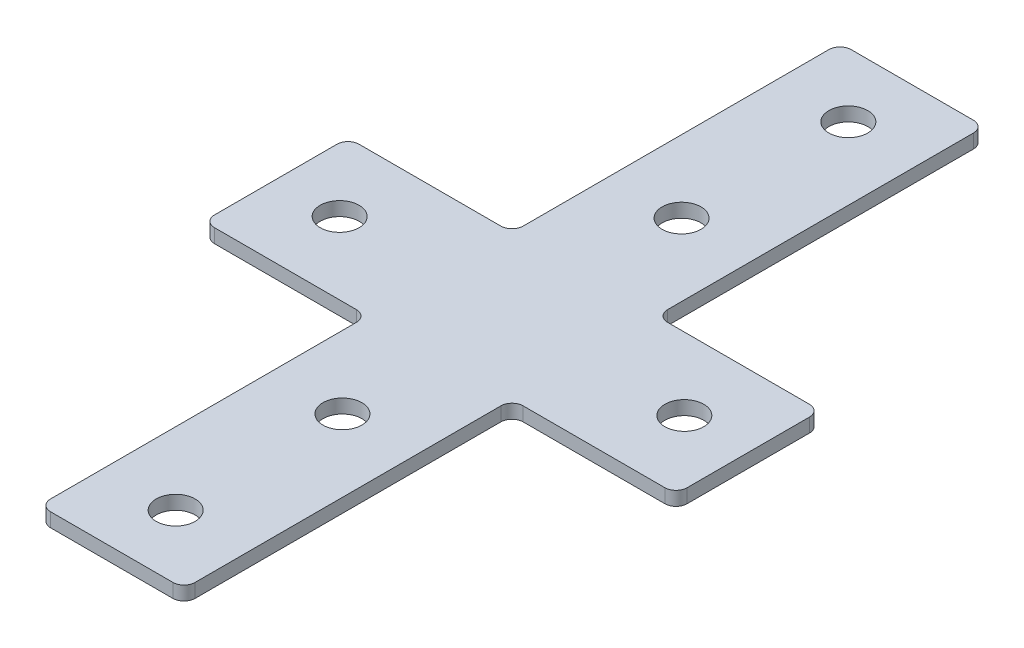
ISO-10303-21;
HEADER;
FILE_DESCRIPTION(('STEP AP214'),'2;1');
FILE_NAME('part.step','',(''),(''),'','','');
FILE_SCHEMA(('AUTOMOTIVE_DESIGN { 1 0 10303 214 1 1 1 1 }'));
ENDSEC;
DATA;
#1=APPLICATION_CONTEXT('core data for automotive mechanical design processes');
#2=APPLICATION_PROTOCOL_DEFINITION('international standard','automotive_design',2000,#1);
#3=PRODUCT_CONTEXT('',#1,'mechanical');
#4=PRODUCT('Part','Part','',(#3));
#5=PRODUCT_RELATED_PRODUCT_CATEGORY('part','',(#4));
#6=PRODUCT_DEFINITION_FORMATION('','',#4);
#7=PRODUCT_DEFINITION_CONTEXT('part definition',#1,'design');
#8=PRODUCT_DEFINITION('design','',#6,#7);
#9=PRODUCT_DEFINITION_SHAPE('','',#8);
#10=(LENGTH_UNIT() NAMED_UNIT(*) SI_UNIT(.MILLI.,.METRE.));
#11=(NAMED_UNIT(*) PLANE_ANGLE_UNIT() SI_UNIT($,.RADIAN.));
#12=(NAMED_UNIT(*) SI_UNIT($,.STERADIAN.) SOLID_ANGLE_UNIT());
#13=UNCERTAINTY_MEASURE_WITH_UNIT(LENGTH_MEASURE(1.E-05),#10,'distance_accuracy_value','');
#14=(GEOMETRIC_REPRESENTATION_CONTEXT(3) GLOBAL_UNCERTAINTY_ASSIGNED_CONTEXT((#13)) GLOBAL_UNIT_ASSIGNED_CONTEXT((#10,
#11,#12)) REPRESENTATION_CONTEXT('',''));
#15=CARTESIAN_POINT('',(0.,0.,0.));
#16=DIRECTION('',(0.,0.,1.));
#17=DIRECTION('',(1.,0.,0.));
#18=AXIS2_PLACEMENT_3D('',#15,#16,#17);
#19=CARTESIAN_POINT('',(0.,2.5,0.));
#20=DIRECTION('',(0.,1.,0.));
#21=DIRECTION('',(0.,0.,1.));
#22=AXIS2_PLACEMENT_3D('',#19,#20,#21);
#23=PLANE('',#22);
#24=CARTESIAN_POINT('',(0.,2.5,-60.5));
#25=DIRECTION('',(0.,1.,0.));
#26=DIRECTION('',(0.,0.,-1.));
#27=AXIS2_PLACEMENT_3D('',#24,#25,#26);
#28=CIRCLE('',#27,3.5);
#29=CARTESIAN_POINT('',(0.,2.5,-64.));
#30=VERTEX_POINT('',#29);
#31=EDGE_CURVE('E506',#30,#30,#28,.T.);
#32=ORIENTED_EDGE('',*,*,#31,.F.);
#33=EDGE_LOOP('',(#32));
#34=FACE_BOUND('',#33,.T.);
#35=CARTESIAN_POINT('',(-31.,2.5,0.));
#36=DIRECTION('',(0.,1.,0.));
#37=DIRECTION('',(0.,0.,1.));
#38=AXIS2_PLACEMENT_3D('',#35,#36,#37);
#39=CIRCLE('',#38,3.5);
#40=CARTESIAN_POINT('',(-31.,2.5,3.5));
#41=VERTEX_POINT('',#40);
#42=EDGE_CURVE('E494',#41,#41,#39,.T.);
#43=ORIENTED_EDGE('',*,*,#42,.F.);
#44=EDGE_LOOP('',(#43));
#45=FACE_BOUND('',#44,.T.);
#46=CARTESIAN_POINT('',(0.,2.5,60.5));
#47=DIRECTION('',(0.,1.,0.));
#48=DIRECTION('',(0.,0.,1.));
#49=AXIS2_PLACEMENT_3D('',#46,#47,#48);
#50=CIRCLE('',#49,3.5);
#51=CARTESIAN_POINT('',(0.,2.5,64.));
#52=VERTEX_POINT('',#51);
#53=EDGE_CURVE('E372',#52,#52,#50,.T.);
#54=ORIENTED_EDGE('',*,*,#53,.F.);
#55=EDGE_LOOP('',(#54));
#56=FACE_BOUND('',#55,.T.);
#57=DIRECTION('',(-1.,0.,0.));
#58=VECTOR('',#57,1.);
#59=CARTESIAN_POINT('',(-42.5,2.5,-13.));
#60=LINE('',#59,#58);
#61=CARTESIAN_POINT('',(-15.,2.5,-13.));
#62=VERTEX_POINT('',#61);
#63=CARTESIAN_POINT('',(-40.5,2.5,-13.));
#64=VERTEX_POINT('',#63);
#65=EDGE_CURVE('E349',#62,#64,#60,.T.);
#66=ORIENTED_EDGE('',*,*,#65,.T.);
#67=CARTESIAN_POINT('',(-40.5,2.5,-11.));
#68=DIRECTION('',(0.,1.,0.));
#69=DIRECTION('',(0.,0.,1.));
#70=AXIS2_PLACEMENT_3D('',#67,#68,#69);
#71=CIRCLE('',#70,2.);
#72=CARTESIAN_POINT('',(-42.5,2.5,-11.));
#73=VERTEX_POINT('',#72);
#74=EDGE_CURVE('E305',#64,#73,#71,.T.);
#75=ORIENTED_EDGE('',*,*,#74,.T.);
#76=DIRECTION('',(0.,0.,1.));
#77=VECTOR('',#76,1.);
#78=CARTESIAN_POINT('',(-42.5,2.5,-13.));
#79=LINE('',#78,#77);
#80=CARTESIAN_POINT('',(-42.5,2.5,11.));
#81=VERTEX_POINT('',#80);
#82=EDGE_CURVE('E355',#73,#81,#79,.T.);
#83=ORIENTED_EDGE('',*,*,#82,.T.);
#84=CARTESIAN_POINT('',(-40.5,2.5,11.));
#85=DIRECTION('',(0.,1.,0.));
#86=DIRECTION('',(0.,0.,1.));
#87=AXIS2_PLACEMENT_3D('',#84,#85,#86);
#88=CIRCLE('',#87,2.);
#89=CARTESIAN_POINT('',(-40.5,2.5,13.));
#90=VERTEX_POINT('',#89);
#91=EDGE_CURVE('E303',#81,#90,#88,.T.);
#92=ORIENTED_EDGE('',*,*,#91,.T.);
#93=DIRECTION('',(1.,0.,0.));
#94=VECTOR('',#93,1.);
#95=CARTESIAN_POINT('',(-42.5,2.5,13.));
#96=LINE('',#95,#94);
#97=CARTESIAN_POINT('',(-15.,2.5,13.));
#98=VERTEX_POINT('',#97);
#99=EDGE_CURVE('E358',#90,#98,#96,.T.);
#100=ORIENTED_EDGE('',*,*,#99,.T.);
#101=CARTESIAN_POINT('',(-15.,2.5,15.));
#102=DIRECTION('',(0.,1.,0.));
#103=DIRECTION('',(0.,0.,1.));
#104=AXIS2_PLACEMENT_3D('',#101,#102,#103);
#105=CIRCLE('',#104,2.);
#106=CARTESIAN_POINT('',(-13.,2.5,15.));
#107=VERTEX_POINT('',#106);
#108=EDGE_CURVE('E210',#98,#107,#105,.F.);
#109=ORIENTED_EDGE('',*,*,#108,.T.);
#110=DIRECTION('',(0.,0.,1.));
#111=VECTOR('',#110,1.);
#112=CARTESIAN_POINT('',(-13.,2.5,13.));
#113=LINE('',#112,#111);
#114=CARTESIAN_POINT('',(-13.,2.5,70.));
#115=VERTEX_POINT('',#114);
#116=EDGE_CURVE('E219',#107,#115,#113,.T.);
#117=ORIENTED_EDGE('',*,*,#116,.T.);
#118=CARTESIAN_POINT('',(-11.,2.5,70.));
#119=DIRECTION('',(0.,1.,0.));
#120=DIRECTION('',(0.,0.,1.));
#121=AXIS2_PLACEMENT_3D('',#118,#119,#120);
#122=CIRCLE('',#121,2.);
#123=CARTESIAN_POINT('',(-11.,2.5,72.));
#124=VERTEX_POINT('',#123);
#125=EDGE_CURVE('E60',#115,#124,#122,.T.);
#126=ORIENTED_EDGE('',*,*,#125,.T.);
#127=DIRECTION('',(1.,0.,0.));
#128=VECTOR('',#127,1.);
#129=CARTESIAN_POINT('',(-13.,2.5,72.));
#130=LINE('',#129,#128);
#131=CARTESIAN_POINT('',(11.,2.5,72.));
#132=VERTEX_POINT('',#131);
#133=EDGE_CURVE('E237',#124,#132,#130,.T.);
#134=ORIENTED_EDGE('',*,*,#133,.T.);
#135=CARTESIAN_POINT('',(11.,2.5,70.));
#136=DIRECTION('',(0.,1.,0.));
#137=DIRECTION('',(0.,0.,1.));
#138=AXIS2_PLACEMENT_3D('',#135,#136,#137);
#139=CIRCLE('',#138,2.);
#140=CARTESIAN_POINT('',(13.,2.5,70.));
#141=VERTEX_POINT('',#140);
#142=EDGE_CURVE('E300',#132,#141,#139,.T.);
#143=ORIENTED_EDGE('',*,*,#142,.T.);
#144=DIRECTION('',(0.,0.,-1.));
#145=VECTOR('',#144,1.);
#146=CARTESIAN_POINT('',(13.,2.5,13.));
#147=LINE('',#146,#145);
#148=CARTESIAN_POINT('',(13.,2.5,15.));
#149=VERTEX_POINT('',#148);
#150=EDGE_CURVE('E231',#141,#149,#147,.T.);
#151=ORIENTED_EDGE('',*,*,#150,.T.);
#152=CARTESIAN_POINT('',(15.,2.5,15.));
#153=DIRECTION('',(0.,1.,0.));
#154=DIRECTION('',(0.,0.,1.));
#155=AXIS2_PLACEMENT_3D('',#152,#153,#154);
#156=CIRCLE('',#155,2.);
#157=CARTESIAN_POINT('',(15.,2.5,13.));
#158=VERTEX_POINT('',#157);
#159=EDGE_CURVE('E323',#149,#158,#156,.F.);
#160=ORIENTED_EDGE('',*,*,#159,.T.);
#161=DIRECTION('',(1.,0.,0.));
#162=VECTOR('',#161,1.);
#163=CARTESIAN_POINT('',(13.,2.5,13.));
#164=LINE('',#163,#162);
#165=CARTESIAN_POINT('',(40.5,2.5,13.));
#166=VERTEX_POINT('',#165);
#167=EDGE_CURVE('E480',#158,#166,#164,.T.);
#168=ORIENTED_EDGE('',*,*,#167,.T.);
#169=CARTESIAN_POINT('',(40.5,2.5,11.));
#170=DIRECTION('',(0.,1.,0.));
#171=DIRECTION('',(0.,0.,1.));
#172=AXIS2_PLACEMENT_3D('',#169,#170,#171);
#173=CIRCLE('',#172,2.);
#174=CARTESIAN_POINT('',(42.5,2.5,11.));
#175=VERTEX_POINT('',#174);
#176=EDGE_CURVE('E298',#166,#175,#173,.T.);
#177=ORIENTED_EDGE('',*,*,#176,.T.);
#178=DIRECTION('',(0.,0.,-1.));
#179=VECTOR('',#178,1.);
#180=CARTESIAN_POINT('',(42.5,2.5,-13.));
#181=LINE('',#180,#179);
#182=CARTESIAN_POINT('',(42.5,2.5,-11.));
#183=VERTEX_POINT('',#182);
#184=EDGE_CURVE('E477',#175,#183,#181,.T.);
#185=ORIENTED_EDGE('',*,*,#184,.T.);
#186=CARTESIAN_POINT('',(40.5,2.5,-11.));
#187=DIRECTION('',(0.,1.,0.));
#188=DIRECTION('',(0.,0.,1.));
#189=AXIS2_PLACEMENT_3D('',#186,#187,#188);
#190=CIRCLE('',#189,2.);
#191=CARTESIAN_POINT('',(40.5,2.5,-13.));
#192=VERTEX_POINT('',#191);
#193=EDGE_CURVE('E296',#183,#192,#190,.T.);
#194=ORIENTED_EDGE('',*,*,#193,.T.);
#195=DIRECTION('',(-1.,0.,0.));
#196=VECTOR('',#195,1.);
#197=CARTESIAN_POINT('',(13.,2.5,-13.));
#198=LINE('',#197,#196);
#199=CARTESIAN_POINT('',(15.,2.5,-13.));
#200=VERTEX_POINT('',#199);
#201=EDGE_CURVE('E472',#192,#200,#198,.T.);
#202=ORIENTED_EDGE('',*,*,#201,.T.);
#203=CARTESIAN_POINT('',(15.,2.5,-15.));
#204=DIRECTION('',(0.,1.,0.));
#205=DIRECTION('',(0.,0.,1.));
#206=AXIS2_PLACEMENT_3D('',#203,#204,#205);
#207=CIRCLE('',#206,2.);
#208=CARTESIAN_POINT('',(13.,2.5,-15.));
#209=VERTEX_POINT('',#208);
#210=EDGE_CURVE('E327',#200,#209,#207,.F.);
#211=ORIENTED_EDGE('',*,*,#210,.T.);
#212=DIRECTION('',(0.,0.,-1.));
#213=VECTOR('',#212,1.);
#214=CARTESIAN_POINT('',(13.,2.5,-72.));
#215=LINE('',#214,#213);
#216=CARTESIAN_POINT('',(13.,2.5,-70.));
#217=VERTEX_POINT('',#216);
#218=EDGE_CURVE('E467',#209,#217,#215,.T.);
#219=ORIENTED_EDGE('',*,*,#218,.T.);
#220=CARTESIAN_POINT('',(11.,2.5,-70.));
#221=DIRECTION('',(0.,1.,0.));
#222=DIRECTION('',(0.,0.,1.));
#223=AXIS2_PLACEMENT_3D('',#220,#221,#222);
#224=CIRCLE('',#223,2.);
#225=CARTESIAN_POINT('',(11.,2.5,-72.));
#226=VERTEX_POINT('',#225);
#227=EDGE_CURVE('E294',#217,#226,#224,.T.);
#228=ORIENTED_EDGE('',*,*,#227,.T.);
#229=DIRECTION('',(-1.,0.,0.));
#230=VECTOR('',#229,1.);
#231=CARTESIAN_POINT('',(-13.,2.5,-72.));
#232=LINE('',#231,#230);
#233=CARTESIAN_POINT('',(-11.,2.5,-72.));
#234=VERTEX_POINT('',#233);
#235=EDGE_CURVE('E360',#226,#234,#232,.T.);
#236=ORIENTED_EDGE('',*,*,#235,.T.);
#237=CARTESIAN_POINT('',(-11.,2.5,-70.));
#238=DIRECTION('',(0.,1.,0.));
#239=DIRECTION('',(0.,0.,1.));
#240=AXIS2_PLACEMENT_3D('',#237,#238,#239);
#241=CIRCLE('',#240,2.);
#242=CARTESIAN_POINT('',(-13.,2.5,-70.));
#243=VERTEX_POINT('',#242);
#244=EDGE_CURVE('E292',#234,#243,#241,.T.);
#245=ORIENTED_EDGE('',*,*,#244,.T.);
#246=DIRECTION('',(0.,0.,1.));
#247=VECTOR('',#246,1.);
#248=CARTESIAN_POINT('',(-13.,2.5,-72.));
#249=LINE('',#248,#247);
#250=CARTESIAN_POINT('',(-13.,2.5,-15.));
#251=VERTEX_POINT('',#250);
#252=EDGE_CURVE('E351',#243,#251,#249,.T.);
#253=ORIENTED_EDGE('',*,*,#252,.T.);
#254=CARTESIAN_POINT('',(-15.,2.5,-15.));
#255=DIRECTION('',(0.,1.,0.));
#256=DIRECTION('',(0.,0.,1.));
#257=AXIS2_PLACEMENT_3D('',#254,#255,#256);
#258=CIRCLE('',#257,2.);
#259=EDGE_CURVE('E11',#251,#62,#258,.F.);
#260=ORIENTED_EDGE('',*,*,#259,.T.);
#261=EDGE_LOOP('',(#66,#75,#83,#92,#100,#109,#117,#126,#134,#143,#151,#160,#168,#177,#185,#194,
#202,#211,#219,#228,#236,#245,#253,#260));
#262=FACE_BOUND('',#261,.T.);
#263=CARTESIAN_POINT('',(0.,2.5,30.5));
#264=DIRECTION('',(0.,1.,0.));
#265=DIRECTION('',(0.,0.,1.));
#266=AXIS2_PLACEMENT_3D('',#263,#264,#265);
#267=CIRCLE('',#266,3.5);
#268=CARTESIAN_POINT('',(0.,2.5,34.));
#269=VERTEX_POINT('',#268);
#270=EDGE_CURVE('E488',#269,#269,#267,.T.);
#271=ORIENTED_EDGE('',*,*,#270,.F.);
#272=EDGE_LOOP('',(#271));
#273=FACE_BOUND('',#272,.T.);
#274=CARTESIAN_POINT('',(31.,2.5,0.));
#275=DIRECTION('',(0.,1.,0.));
#276=DIRECTION('',(0.,0.,1.));
#277=AXIS2_PLACEMENT_3D('',#274,#275,#276);
#278=CIRCLE('',#277,3.5);
#279=CARTESIAN_POINT('',(31.,2.5,3.5));
#280=VERTEX_POINT('',#279);
#281=EDGE_CURVE('E500',#280,#280,#278,.T.);
#282=ORIENTED_EDGE('',*,*,#281,.F.);
#283=EDGE_LOOP('',(#282));
#284=FACE_BOUND('',#283,.T.);
#285=CARTESIAN_POINT('',(0.,2.5,-30.5));
#286=DIRECTION('',(0.,1.,0.));
#287=DIRECTION('',(0.,0.,-1.));
#288=AXIS2_PLACEMENT_3D('',#285,#286,#287);
#289=CIRCLE('',#288,3.5);
#290=CARTESIAN_POINT('',(0.,2.5,-34.));
#291=VERTEX_POINT('',#290);
#292=EDGE_CURVE('E512',#291,#291,#289,.T.);
#293=ORIENTED_EDGE('',*,*,#292,.F.);
#294=EDGE_LOOP('',(#293));
#295=FACE_BOUND('',#294,.T.);
#296=ADVANCED_FACE('F38',(#34,#45,#56,#262,#273,#284,#295),#23,.T.);
#297=CARTESIAN_POINT('',(0.,0.,0.));
#298=DIRECTION('',(0.,1.,0.));
#299=DIRECTION('',(0.,0.,1.));
#300=AXIS2_PLACEMENT_3D('',#297,#298,#299);
#301=PLANE('',#300);
#302=DIRECTION('',(0.,0.,1.));
#303=VECTOR('',#302,1.);
#304=CARTESIAN_POINT('',(-42.5,0.,-13.));
#305=LINE('',#304,#303);
#306=CARTESIAN_POINT('',(-42.5,0.,-11.));
#307=VERTEX_POINT('',#306);
#308=CARTESIAN_POINT('',(-42.5,0.,11.));
#309=VERTEX_POINT('',#308);
#310=EDGE_CURVE('E233',#307,#309,#305,.T.);
#311=ORIENTED_EDGE('',*,*,#310,.F.);
#312=CARTESIAN_POINT('',(-40.5,0.,-11.));
#313=DIRECTION('',(0.,1.,0.));
#314=DIRECTION('',(0.,0.,1.));
#315=AXIS2_PLACEMENT_3D('',#312,#313,#314);
#316=CIRCLE('',#315,2.);
#317=CARTESIAN_POINT('',(-40.5,0.,-13.));
#318=VERTEX_POINT('',#317);
#319=EDGE_CURVE('E290',#307,#318,#316,.F.);
#320=ORIENTED_EDGE('',*,*,#319,.T.);
#321=DIRECTION('',(-1.,0.,0.));
#322=VECTOR('',#321,1.);
#323=CARTESIAN_POINT('',(-42.5,0.,-13.));
#324=LINE('',#323,#322);
#325=CARTESIAN_POINT('',(-15.,0.,-13.));
#326=VERTEX_POINT('',#325);
#327=EDGE_CURVE('E333',#326,#318,#324,.T.);
#328=ORIENTED_EDGE('',*,*,#327,.F.);
#329=CARTESIAN_POINT('',(-15.,0.,-15.));
#330=DIRECTION('',(0.,1.,0.));
#331=DIRECTION('',(0.,0.,1.));
#332=AXIS2_PLACEMENT_3D('',#329,#330,#331);
#333=CIRCLE('',#332,2.);
#334=CARTESIAN_POINT('',(-13.,0.,-15.));
#335=VERTEX_POINT('',#334);
#336=EDGE_CURVE('E46',#326,#335,#333,.T.);
#337=ORIENTED_EDGE('',*,*,#336,.T.);
#338=DIRECTION('',(0.,0.,1.));
#339=VECTOR('',#338,1.);
#340=CARTESIAN_POINT('',(-13.,0.,-72.));
#341=LINE('',#340,#339);
#342=CARTESIAN_POINT('',(-13.,0.,-70.));
#343=VERTEX_POINT('',#342);
#344=EDGE_CURVE('E331',#343,#335,#341,.T.);
#345=ORIENTED_EDGE('',*,*,#344,.F.);
#346=CARTESIAN_POINT('',(-11.,0.,-70.));
#347=DIRECTION('',(0.,1.,0.));
#348=DIRECTION('',(0.,0.,1.));
#349=AXIS2_PLACEMENT_3D('',#346,#347,#348);
#350=CIRCLE('',#349,2.);
#351=CARTESIAN_POINT('',(-11.,0.,-72.));
#352=VERTEX_POINT('',#351);
#353=EDGE_CURVE('E277',#343,#352,#350,.F.);
#354=ORIENTED_EDGE('',*,*,#353,.T.);
#355=DIRECTION('',(-1.,0.,0.));
#356=VECTOR('',#355,1.);
#357=CARTESIAN_POINT('',(-13.,0.,-72.));
#358=LINE('',#357,#356);
#359=CARTESIAN_POINT('',(11.,0.,-72.));
#360=VERTEX_POINT('',#359);
#361=EDGE_CURVE('E342',#360,#352,#358,.T.);
#362=ORIENTED_EDGE('',*,*,#361,.F.);
#363=CARTESIAN_POINT('',(11.,0.,-70.));
#364=DIRECTION('',(0.,1.,0.));
#365=DIRECTION('',(0.,0.,1.));
#366=AXIS2_PLACEMENT_3D('',#363,#364,#365);
#367=CIRCLE('',#366,2.);
#368=CARTESIAN_POINT('',(13.,0.,-70.));
#369=VERTEX_POINT('',#368);
#370=EDGE_CURVE('E279',#360,#369,#367,.F.);
#371=ORIENTED_EDGE('',*,*,#370,.T.);
#372=DIRECTION('',(0.,0.,-1.));
#373=VECTOR('',#372,1.);
#374=CARTESIAN_POINT('',(13.,0.,-72.));
#375=LINE('',#374,#373);
#376=CARTESIAN_POINT('',(13.,0.,-15.));
#377=VERTEX_POINT('',#376);
#378=EDGE_CURVE('E381',#377,#369,#375,.T.);
#379=ORIENTED_EDGE('',*,*,#378,.F.);
#380=CARTESIAN_POINT('',(15.,0.,-15.));
#381=DIRECTION('',(0.,1.,0.));
#382=DIRECTION('',(0.,0.,1.));
#383=AXIS2_PLACEMENT_3D('',#380,#381,#382);
#384=CIRCLE('',#383,2.);
#385=CARTESIAN_POINT('',(15.,0.,-13.));
#386=VERTEX_POINT('',#385);
#387=EDGE_CURVE('E325',#377,#386,#384,.T.);
#388=ORIENTED_EDGE('',*,*,#387,.T.);
#389=DIRECTION('',(-1.,0.,0.));
#390=VECTOR('',#389,1.);
#391=CARTESIAN_POINT('',(13.,0.,-13.));
#392=LINE('',#391,#390);
#393=CARTESIAN_POINT('',(40.5,0.,-13.));
#394=VERTEX_POINT('',#393);
#395=EDGE_CURVE('E378',#394,#386,#392,.T.);
#396=ORIENTED_EDGE('',*,*,#395,.F.);
#397=CARTESIAN_POINT('',(40.5,0.,-11.));
#398=DIRECTION('',(0.,1.,0.));
#399=DIRECTION('',(0.,0.,1.));
#400=AXIS2_PLACEMENT_3D('',#397,#398,#399);
#401=CIRCLE('',#400,2.);
#402=CARTESIAN_POINT('',(42.5,0.,-11.));
#403=VERTEX_POINT('',#402);
#404=EDGE_CURVE('E281',#394,#403,#401,.F.);
#405=ORIENTED_EDGE('',*,*,#404,.T.);
#406=DIRECTION('',(0.,0.,-1.));
#407=VECTOR('',#406,1.);
#408=CARTESIAN_POINT('',(42.5,0.,-13.));
#409=LINE('',#408,#407);
#410=CARTESIAN_POINT('',(42.5,0.,11.));
#411=VERTEX_POINT('',#410);
#412=EDGE_CURVE('E375',#411,#403,#409,.T.);
#413=ORIENTED_EDGE('',*,*,#412,.F.);
#414=CARTESIAN_POINT('',(40.5,0.,11.));
#415=DIRECTION('',(0.,1.,0.));
#416=DIRECTION('',(0.,0.,1.));
#417=AXIS2_PLACEMENT_3D('',#414,#415,#416);
#418=CIRCLE('',#417,2.);
#419=CARTESIAN_POINT('',(40.5,0.,13.));
#420=VERTEX_POINT('',#419);
#421=EDGE_CURVE('E283',#411,#420,#418,.F.);
#422=ORIENTED_EDGE('',*,*,#421,.T.);
#423=DIRECTION('',(1.,0.,0.));
#424=VECTOR('',#423,1.);
#425=CARTESIAN_POINT('',(13.,0.,13.));
#426=LINE('',#425,#424);
#427=CARTESIAN_POINT('',(15.,0.,13.));
#428=VERTEX_POINT('',#427);
#429=EDGE_CURVE('E371',#428,#420,#426,.T.);
#430=ORIENTED_EDGE('',*,*,#429,.F.);
#431=CARTESIAN_POINT('',(15.,0.,15.));
#432=DIRECTION('',(0.,1.,0.));
#433=DIRECTION('',(0.,0.,1.));
#434=AXIS2_PLACEMENT_3D('',#431,#432,#433);
#435=CIRCLE('',#434,2.);
#436=CARTESIAN_POINT('',(13.,0.,15.));
#437=VERTEX_POINT('',#436);
#438=EDGE_CURVE('E321',#428,#437,#435,.T.);
#439=ORIENTED_EDGE('',*,*,#438,.T.);
#440=DIRECTION('',(0.,0.,-1.));
#441=VECTOR('',#440,1.);
#442=CARTESIAN_POINT('',(13.,0.,13.));
#443=LINE('',#442,#441);
#444=CARTESIAN_POINT('',(13.,0.,70.));
#445=VERTEX_POINT('',#444);
#446=EDGE_CURVE('E368',#445,#437,#443,.T.);
#447=ORIENTED_EDGE('',*,*,#446,.F.);
#448=CARTESIAN_POINT('',(11.,0.,70.));
#449=DIRECTION('',(0.,1.,0.));
#450=DIRECTION('',(0.,0.,1.));
#451=AXIS2_PLACEMENT_3D('',#448,#449,#450);
#452=CIRCLE('',#451,2.);
#453=CARTESIAN_POINT('',(11.,0.,72.));
#454=VERTEX_POINT('',#453);
#455=EDGE_CURVE('E285',#445,#454,#452,.F.);
#456=ORIENTED_EDGE('',*,*,#455,.T.);
#457=DIRECTION('',(1.,0.,0.));
#458=VECTOR('',#457,1.);
#459=CARTESIAN_POINT('',(-13.,0.,72.));
#460=LINE('',#459,#458);
#461=CARTESIAN_POINT('',(-11.,0.,72.));
#462=VERTEX_POINT('',#461);
#463=EDGE_CURVE('E228',#462,#454,#460,.T.);
#464=ORIENTED_EDGE('',*,*,#463,.F.);
#465=CARTESIAN_POINT('',(-11.,0.,70.));
#466=DIRECTION('',(0.,1.,0.));
#467=DIRECTION('',(0.,0.,1.));
#468=AXIS2_PLACEMENT_3D('',#465,#466,#467);
#469=CIRCLE('',#468,2.);
#470=CARTESIAN_POINT('',(-13.,0.,70.));
#471=VERTEX_POINT('',#470);
#472=EDGE_CURVE('E227',#462,#471,#469,.F.);
#473=ORIENTED_EDGE('',*,*,#472,.T.);
#474=DIRECTION('',(0.,0.,1.));
#475=VECTOR('',#474,1.);
#476=CARTESIAN_POINT('',(-13.,0.,13.));
#477=LINE('',#476,#475);
#478=CARTESIAN_POINT('',(-13.,0.,15.));
#479=VERTEX_POINT('',#478);
#480=EDGE_CURVE('E217',#479,#471,#477,.T.);
#481=ORIENTED_EDGE('',*,*,#480,.F.);
#482=CARTESIAN_POINT('',(-15.,0.,15.));
#483=DIRECTION('',(0.,1.,0.));
#484=DIRECTION('',(0.,0.,1.));
#485=AXIS2_PLACEMENT_3D('',#482,#483,#484);
#486=CIRCLE('',#485,2.);
#487=CARTESIAN_POINT('',(-15.,0.,13.));
#488=VERTEX_POINT('',#487);
#489=EDGE_CURVE('E200',#479,#488,#486,.T.);
#490=ORIENTED_EDGE('',*,*,#489,.T.);
#491=DIRECTION('',(1.,0.,0.));
#492=VECTOR('',#491,1.);
#493=CARTESIAN_POINT('',(-42.5,0.,13.));
#494=LINE('',#493,#492);
#495=CARTESIAN_POINT('',(-40.5,0.,13.));
#496=VERTEX_POINT('',#495);
#497=EDGE_CURVE('E229',#496,#488,#494,.T.);
#498=ORIENTED_EDGE('',*,*,#497,.F.);
#499=CARTESIAN_POINT('',(-40.5,0.,11.));
#500=DIRECTION('',(0.,1.,0.));
#501=DIRECTION('',(0.,0.,1.));
#502=AXIS2_PLACEMENT_3D('',#499,#500,#501);
#503=CIRCLE('',#502,2.);
#504=EDGE_CURVE('E288',#496,#309,#503,.F.);
#505=ORIENTED_EDGE('',*,*,#504,.T.);
#506=EDGE_LOOP('',(#311,#320,#328,#337,#345,#354,#362,#371,#379,#388,#396,#405,#413,#422,#430,
#439,#447,#456,#464,#473,#481,#490,#498,#505));
#507=FACE_BOUND('',#506,.T.);
#508=CARTESIAN_POINT('',(0.,0.,60.5));
#509=DIRECTION('',(0.,1.,0.));
#510=DIRECTION('',(0.,0.,1.));
#511=AXIS2_PLACEMENT_3D('',#508,#509,#510);
#512=CIRCLE('',#511,3.5);
#513=CARTESIAN_POINT('',(0.,0.,64.));
#514=VERTEX_POINT('',#513);
#515=EDGE_CURVE('E485',#514,#514,#512,.T.);
#516=ORIENTED_EDGE('',*,*,#515,.T.);
#517=EDGE_LOOP('',(#516));
#518=FACE_BOUND('',#517,.T.);
#519=CARTESIAN_POINT('',(0.,0.,30.5));
#520=DIRECTION('',(0.,1.,0.));
#521=DIRECTION('',(0.,0.,1.));
#522=AXIS2_PLACEMENT_3D('',#519,#520,#521);
#523=CIRCLE('',#522,3.5);
#524=CARTESIAN_POINT('',(0.,0.,34.));
#525=VERTEX_POINT('',#524);
#526=EDGE_CURVE('E491',#525,#525,#523,.T.);
#527=ORIENTED_EDGE('',*,*,#526,.T.);
#528=EDGE_LOOP('',(#527));
#529=FACE_BOUND('',#528,.T.);
#530=CARTESIAN_POINT('',(-31.,0.,0.));
#531=DIRECTION('',(0.,1.,0.));
#532=DIRECTION('',(0.,0.,1.));
#533=AXIS2_PLACEMENT_3D('',#530,#531,#532);
#534=CIRCLE('',#533,3.5);
#535=CARTESIAN_POINT('',(-31.,0.,3.5));
#536=VERTEX_POINT('',#535);
#537=EDGE_CURVE('E497',#536,#536,#534,.T.);
#538=ORIENTED_EDGE('',*,*,#537,.T.);
#539=EDGE_LOOP('',(#538));
#540=FACE_BOUND('',#539,.T.);
#541=CARTESIAN_POINT('',(31.,0.,0.));
#542=DIRECTION('',(0.,1.,0.));
#543=DIRECTION('',(0.,0.,1.));
#544=AXIS2_PLACEMENT_3D('',#541,#542,#543);
#545=CIRCLE('',#544,3.5);
#546=CARTESIAN_POINT('',(31.,0.,3.5));
#547=VERTEX_POINT('',#546);
#548=EDGE_CURVE('E503',#547,#547,#545,.T.);
#549=ORIENTED_EDGE('',*,*,#548,.T.);
#550=EDGE_LOOP('',(#549));
#551=FACE_BOUND('',#550,.T.);
#552=CARTESIAN_POINT('',(0.,0.,-60.5));
#553=DIRECTION('',(0.,1.,0.));
#554=DIRECTION('',(0.,0.,-1.));
#555=AXIS2_PLACEMENT_3D('',#552,#553,#554);
#556=CIRCLE('',#555,3.5);
#557=CARTESIAN_POINT('',(0.,0.,-64.));
#558=VERTEX_POINT('',#557);
#559=EDGE_CURVE('E509',#558,#558,#556,.T.);
#560=ORIENTED_EDGE('',*,*,#559,.T.);
#561=EDGE_LOOP('',(#560));
#562=FACE_BOUND('',#561,.T.);
#563=CARTESIAN_POINT('',(0.,0.,-30.5));
#564=DIRECTION('',(0.,1.,0.));
#565=DIRECTION('',(0.,0.,-1.));
#566=AXIS2_PLACEMENT_3D('',#563,#564,#565);
#567=CIRCLE('',#566,3.5);
#568=CARTESIAN_POINT('',(0.,0.,-34.));
#569=VERTEX_POINT('',#568);
#570=EDGE_CURVE('E515',#569,#569,#567,.T.);
#571=ORIENTED_EDGE('',*,*,#570,.T.);
#572=EDGE_LOOP('',(#571));
#573=FACE_BOUND('',#572,.T.);
#574=ADVANCED_FACE('F224',(#507,#518,#529,#540,#551,#562,#573),#301,.F.);
#575=CARTESIAN_POINT('',(13.,2.5,13.));
#576=DIRECTION('',(-1.,0.,0.));
#577=DIRECTION('',(0.,0.,1.));
#578=AXIS2_PLACEMENT_3D('',#575,#576,#577);
#579=PLANE('',#578);
#580=ORIENTED_EDGE('',*,*,#446,.T.);
#581=DIRECTION('',(0.,-1.,0.));
#582=VECTOR('',#581,1.);
#583=CARTESIAN_POINT('',(13.,2.5,15.));
#584=LINE('',#583,#582);
#585=EDGE_CURVE('E250',#437,#149,#584,.F.);
#586=ORIENTED_EDGE('',*,*,#585,.T.);
#587=ORIENTED_EDGE('',*,*,#150,.F.);
#588=DIRECTION('',(0.,-1.,0.));
#589=VECTOR('',#588,1.);
#590=CARTESIAN_POINT('',(13.,2.5,70.));
#591=LINE('',#590,#589);
#592=EDGE_CURVE('E247',#141,#445,#591,.T.);
#593=ORIENTED_EDGE('',*,*,#592,.T.);
#594=EDGE_LOOP('',(#580,#586,#587,#593));
#595=FACE_BOUND('',#594,.T.);
#596=ADVANCED_FACE('F414',(#595),#579,.F.);
#597=CARTESIAN_POINT('',(13.,2.5,13.));
#598=DIRECTION('',(0.,0.,-1.));
#599=DIRECTION('',(-1.,0.,0.));
#600=AXIS2_PLACEMENT_3D('',#597,#598,#599);
#601=PLANE('',#600);
#602=ORIENTED_EDGE('',*,*,#167,.F.);
#603=DIRECTION('',(0.,-1.,0.));
#604=VECTOR('',#603,1.);
#605=CARTESIAN_POINT('',(15.,0.,13.));
#606=LINE('',#605,#604);
#607=EDGE_CURVE('E244',#158,#428,#606,.T.);
#608=ORIENTED_EDGE('',*,*,#607,.T.);
#609=ORIENTED_EDGE('',*,*,#429,.T.);
#610=DIRECTION('',(0.,-1.,0.));
#611=VECTOR('',#610,1.);
#612=CARTESIAN_POINT('',(40.5,2.5,13.));
#613=LINE('',#612,#611);
#614=EDGE_CURVE('E242',#420,#166,#613,.F.);
#615=ORIENTED_EDGE('',*,*,#614,.T.);
#616=EDGE_LOOP('',(#602,#608,#609,#615));
#617=FACE_BOUND('',#616,.T.);
#618=ADVANCED_FACE('F602',(#617),#601,.F.);
#619=CARTESIAN_POINT('',(42.5,2.5,-13.));
#620=DIRECTION('',(-1.,0.,0.));
#621=DIRECTION('',(0.,0.,1.));
#622=AXIS2_PLACEMENT_3D('',#619,#620,#621);
#623=PLANE('',#622);
#624=ORIENTED_EDGE('',*,*,#184,.F.);
#625=DIRECTION('',(0.,-1.,0.));
#626=VECTOR('',#625,1.);
#627=CARTESIAN_POINT('',(42.5,2.5,11.));
#628=LINE('',#627,#626);
#629=EDGE_CURVE('E313',#175,#411,#628,.T.);
#630=ORIENTED_EDGE('',*,*,#629,.T.);
#631=ORIENTED_EDGE('',*,*,#412,.T.);
#632=DIRECTION('',(0.,-1.,0.));
#633=VECTOR('',#632,1.);
#634=CARTESIAN_POINT('',(42.5,2.5,-11.));
#635=LINE('',#634,#633);
#636=EDGE_CURVE('E311',#403,#183,#635,.F.);
#637=ORIENTED_EDGE('',*,*,#636,.T.);
#638=EDGE_LOOP('',(#624,#630,#631,#637));
#639=FACE_BOUND('',#638,.T.);
#640=ADVANCED_FACE('F612',(#639),#623,.F.);
#641=CARTESIAN_POINT('',(13.,2.5,-13.));
#642=DIRECTION('',(0.,0.,1.));
#643=DIRECTION('',(1.,0.,0.));
#644=AXIS2_PLACEMENT_3D('',#641,#642,#643);
#645=PLANE('',#644);
#646=ORIENTED_EDGE('',*,*,#395,.T.);
#647=DIRECTION('',(0.,-1.,0.));
#648=VECTOR('',#647,1.);
#649=CARTESIAN_POINT('',(15.,2.5,-13.));
#650=LINE('',#649,#648);
#651=EDGE_CURVE('E260',#386,#200,#650,.F.);
#652=ORIENTED_EDGE('',*,*,#651,.T.);
#653=ORIENTED_EDGE('',*,*,#201,.F.);
#654=DIRECTION('',(0.,-1.,0.));
#655=VECTOR('',#654,1.);
#656=CARTESIAN_POINT('',(40.5,2.5,-13.));
#657=LINE('',#656,#655);
#658=EDGE_CURVE('E257',#192,#394,#657,.T.);
#659=ORIENTED_EDGE('',*,*,#658,.T.);
#660=EDGE_LOOP('',(#646,#652,#653,#659));
#661=FACE_BOUND('',#660,.T.);
#662=ADVANCED_FACE('F622',(#661),#645,.F.);
#663=CARTESIAN_POINT('',(13.,2.5,-72.));
#664=DIRECTION('',(-1.,0.,0.));
#665=DIRECTION('',(0.,0.,1.));
#666=AXIS2_PLACEMENT_3D('',#663,#664,#665);
#667=PLANE('',#666);
#668=ORIENTED_EDGE('',*,*,#218,.F.);
#669=DIRECTION('',(0.,-1.,0.));
#670=VECTOR('',#669,1.);
#671=CARTESIAN_POINT('',(13.,0.,-15.));
#672=LINE('',#671,#670);
#673=EDGE_CURVE('E254',#209,#377,#672,.T.);
#674=ORIENTED_EDGE('',*,*,#673,.T.);
#675=ORIENTED_EDGE('',*,*,#378,.T.);
#676=DIRECTION('',(0.,-1.,0.));
#677=VECTOR('',#676,1.);
#678=CARTESIAN_POINT('',(13.,2.5,-70.));
#679=LINE('',#678,#677);
#680=EDGE_CURVE('E252',#369,#217,#679,.F.);
#681=ORIENTED_EDGE('',*,*,#680,.T.);
#682=EDGE_LOOP('',(#668,#674,#675,#681));
#683=FACE_BOUND('',#682,.T.);
#684=ADVANCED_FACE('F632',(#683),#667,.F.);
#685=CARTESIAN_POINT('',(-13.,2.5,-72.));
#686=DIRECTION('',(0.,0.,1.));
#687=DIRECTION('',(1.,0.,0.));
#688=AXIS2_PLACEMENT_3D('',#685,#686,#687);
#689=PLANE('',#688);
#690=ORIENTED_EDGE('',*,*,#235,.F.);
#691=DIRECTION('',(0.,-1.,0.));
#692=VECTOR('',#691,1.);
#693=CARTESIAN_POINT('',(11.,2.5,-72.));
#694=LINE('',#693,#692);
#695=EDGE_CURVE('E211',#226,#360,#694,.T.);
#696=ORIENTED_EDGE('',*,*,#695,.T.);
#697=ORIENTED_EDGE('',*,*,#361,.T.);
#698=DIRECTION('',(0.,-1.,0.));
#699=VECTOR('',#698,1.);
#700=CARTESIAN_POINT('',(-11.,2.5,-72.));
#701=LINE('',#700,#699);
#702=EDGE_CURVE('E316',#352,#234,#701,.F.);
#703=ORIENTED_EDGE('',*,*,#702,.T.);
#704=EDGE_LOOP('',(#690,#696,#697,#703));
#705=FACE_BOUND('',#704,.T.);
#706=ADVANCED_FACE('F469',(#705),#689,.F.);
#707=CARTESIAN_POINT('',(-13.,2.5,-72.));
#708=DIRECTION('',(1.,0.,0.));
#709=DIRECTION('',(0.,0.,-1.));
#710=AXIS2_PLACEMENT_3D('',#707,#708,#709);
#711=PLANE('',#710);
#712=ORIENTED_EDGE('',*,*,#344,.T.);
#713=DIRECTION('',(0.,-1.,0.));
#714=VECTOR('',#713,1.);
#715=CARTESIAN_POINT('',(-13.,2.5,-15.));
#716=LINE('',#715,#714);
#717=EDGE_CURVE('E270',#335,#251,#716,.F.);
#718=ORIENTED_EDGE('',*,*,#717,.T.);
#719=ORIENTED_EDGE('',*,*,#252,.F.);
#720=DIRECTION('',(0.,-1.,0.));
#721=VECTOR('',#720,1.);
#722=CARTESIAN_POINT('',(-13.,2.5,-70.));
#723=LINE('',#722,#721);
#724=EDGE_CURVE('E267',#243,#343,#723,.T.);
#725=ORIENTED_EDGE('',*,*,#724,.T.);
#726=EDGE_LOOP('',(#712,#718,#719,#725));
#727=FACE_BOUND('',#726,.T.);
#728=ADVANCED_FACE('F338',(#727),#711,.F.);
#729=CARTESIAN_POINT('',(-42.5,2.5,-13.));
#730=DIRECTION('',(0.,0.,1.));
#731=DIRECTION('',(1.,0.,0.));
#732=AXIS2_PLACEMENT_3D('',#729,#730,#731);
#733=PLANE('',#732);
#734=ORIENTED_EDGE('',*,*,#65,.F.);
#735=DIRECTION('',(0.,-1.,0.));
#736=VECTOR('',#735,1.);
#737=CARTESIAN_POINT('',(-15.,0.,-13.));
#738=LINE('',#737,#736);
#739=EDGE_CURVE('E264',#62,#326,#738,.T.);
#740=ORIENTED_EDGE('',*,*,#739,.T.);
#741=ORIENTED_EDGE('',*,*,#327,.T.);
#742=DIRECTION('',(0.,-1.,0.));
#743=VECTOR('',#742,1.);
#744=CARTESIAN_POINT('',(-40.5,2.5,-13.));
#745=LINE('',#744,#743);
#746=EDGE_CURVE('E262',#318,#64,#745,.F.);
#747=ORIENTED_EDGE('',*,*,#746,.T.);
#748=EDGE_LOOP('',(#734,#740,#741,#747));
#749=FACE_BOUND('',#748,.T.);
#750=ADVANCED_FACE('F353',(#749),#733,.F.);
#751=CARTESIAN_POINT('',(-42.5,2.5,-13.));
#752=DIRECTION('',(1.,0.,0.));
#753=DIRECTION('',(0.,0.,-1.));
#754=AXIS2_PLACEMENT_3D('',#751,#752,#753);
#755=PLANE('',#754);
#756=ORIENTED_EDGE('',*,*,#82,.F.);
#757=DIRECTION('',(0.,-1.,0.));
#758=VECTOR('',#757,1.);
#759=CARTESIAN_POINT('',(-42.5,2.5,-11.));
#760=LINE('',#759,#758);
#761=EDGE_CURVE('E274',#73,#307,#760,.T.);
#762=ORIENTED_EDGE('',*,*,#761,.T.);
#763=ORIENTED_EDGE('',*,*,#310,.T.);
#764=DIRECTION('',(0.,-1.,0.));
#765=VECTOR('',#764,1.);
#766=CARTESIAN_POINT('',(-42.5,2.5,11.));
#767=LINE('',#766,#765);
#768=EDGE_CURVE('E272',#309,#81,#767,.F.);
#769=ORIENTED_EDGE('',*,*,#768,.T.);
#770=EDGE_LOOP('',(#756,#762,#763,#769));
#771=FACE_BOUND('',#770,.T.);
#772=ADVANCED_FACE('F390',(#771),#755,.F.);
#773=CARTESIAN_POINT('',(-42.5,2.5,13.));
#774=DIRECTION('',(0.,0.,-1.));
#775=DIRECTION('',(-1.,0.,0.));
#776=AXIS2_PLACEMENT_3D('',#773,#774,#775);
#777=PLANE('',#776);
#778=ORIENTED_EDGE('',*,*,#497,.T.);
#779=DIRECTION('',(0.,-1.,0.));
#780=VECTOR('',#779,1.);
#781=CARTESIAN_POINT('',(-15.,2.5,13.));
#782=LINE('',#781,#780);
#783=EDGE_CURVE('E205',#488,#98,#782,.F.);
#784=ORIENTED_EDGE('',*,*,#783,.T.);
#785=ORIENTED_EDGE('',*,*,#99,.F.);
#786=DIRECTION('',(0.,-1.,0.));
#787=VECTOR('',#786,1.);
#788=CARTESIAN_POINT('',(-40.5,2.5,13.));
#789=LINE('',#788,#787);
#790=EDGE_CURVE('E220',#90,#496,#789,.T.);
#791=ORIENTED_EDGE('',*,*,#790,.T.);
#792=EDGE_LOOP('',(#778,#784,#785,#791));
#793=FACE_BOUND('',#792,.T.);
#794=ADVANCED_FACE('F398',(#793),#777,.F.);
#795=CARTESIAN_POINT('',(-13.,2.5,13.));
#796=DIRECTION('',(1.,0.,0.));
#797=DIRECTION('',(0.,0.,-1.));
#798=AXIS2_PLACEMENT_3D('',#795,#796,#797);
#799=PLANE('',#798);
#800=ORIENTED_EDGE('',*,*,#116,.F.);
#801=DIRECTION('',(0.,-1.,0.));
#802=VECTOR('',#801,1.);
#803=CARTESIAN_POINT('',(-13.,0.,15.));
#804=LINE('',#803,#802);
#805=EDGE_CURVE('E204',#107,#479,#804,.T.);
#806=ORIENTED_EDGE('',*,*,#805,.T.);
#807=ORIENTED_EDGE('',*,*,#480,.T.);
#808=DIRECTION('',(0.,-1.,0.));
#809=VECTOR('',#808,1.);
#810=CARTESIAN_POINT('',(-13.,2.5,70.));
#811=LINE('',#810,#809);
#812=EDGE_CURVE('E221',#471,#115,#811,.F.);
#813=ORIENTED_EDGE('',*,*,#812,.T.);
#814=EDGE_LOOP('',(#800,#806,#807,#813));
#815=FACE_BOUND('',#814,.T.);
#816=ADVANCED_FACE('F216',(#815),#799,.F.);
#817=CARTESIAN_POINT('',(-13.,2.5,72.));
#818=DIRECTION('',(0.,0.,-1.));
#819=DIRECTION('',(-1.,0.,0.));
#820=AXIS2_PLACEMENT_3D('',#817,#818,#819);
#821=PLANE('',#820);
#822=ORIENTED_EDGE('',*,*,#133,.F.);
#823=DIRECTION('',(0.,-1.,0.));
#824=VECTOR('',#823,1.);
#825=CARTESIAN_POINT('',(-11.,2.5,72.));
#826=LINE('',#825,#824);
#827=EDGE_CURVE('E308',#124,#462,#826,.T.);
#828=ORIENTED_EDGE('',*,*,#827,.T.);
#829=ORIENTED_EDGE('',*,*,#463,.T.);
#830=DIRECTION('',(0.,-1.,0.));
#831=VECTOR('',#830,1.);
#832=CARTESIAN_POINT('',(11.,2.5,72.));
#833=LINE('',#832,#831);
#834=EDGE_CURVE('E53',#454,#132,#833,.F.);
#835=ORIENTED_EDGE('',*,*,#834,.T.);
#836=EDGE_LOOP('',(#822,#828,#829,#835));
#837=FACE_BOUND('',#836,.T.);
#838=ADVANCED_FACE('F405',(#837),#821,.F.);
#839=CARTESIAN_POINT('',(0.,2.5,60.5));
#840=DIRECTION('',(0.,-1.,0.));
#841=DIRECTION('',(0.,0.,-1.));
#842=AXIS2_PLACEMENT_3D('',#839,#840,#841);
#843=CYLINDRICAL_SURFACE('',#842,3.5);
#844=ORIENTED_EDGE('',*,*,#53,.T.);
#845=EDGE_LOOP('',(#844));
#846=FACE_BOUND('',#845,.T.);
#847=ORIENTED_EDGE('',*,*,#515,.F.);
#848=EDGE_LOOP('',(#847));
#849=FACE_BOUND('',#848,.T.);
#850=ADVANCED_FACE('F419',(#846,#849),#843,.F.);
#851=CARTESIAN_POINT('',(0.,2.5,30.5));
#852=DIRECTION('',(0.,-1.,0.));
#853=DIRECTION('',(0.,0.,-1.));
#854=AXIS2_PLACEMENT_3D('',#851,#852,#853);
#855=CYLINDRICAL_SURFACE('',#854,3.5);
#856=ORIENTED_EDGE('',*,*,#270,.T.);
#857=EDGE_LOOP('',(#856));
#858=FACE_BOUND('',#857,.T.);
#859=ORIENTED_EDGE('',*,*,#526,.F.);
#860=EDGE_LOOP('',(#859));
#861=FACE_BOUND('',#860,.T.);
#862=ADVANCED_FACE('F426',(#858,#861),#855,.F.);
#863=CARTESIAN_POINT('',(-31.,2.5,0.));
#864=DIRECTION('',(0.,-1.,0.));
#865=DIRECTION('',(0.,0.,-1.));
#866=AXIS2_PLACEMENT_3D('',#863,#864,#865);
#867=CYLINDRICAL_SURFACE('',#866,3.5);
#868=ORIENTED_EDGE('',*,*,#42,.T.);
#869=EDGE_LOOP('',(#868));
#870=FACE_BOUND('',#869,.T.);
#871=ORIENTED_EDGE('',*,*,#537,.F.);
#872=EDGE_LOOP('',(#871));
#873=FACE_BOUND('',#872,.T.);
#874=ADVANCED_FACE('F541',(#870,#873),#867,.F.);
#875=CARTESIAN_POINT('',(31.,2.5,0.));
#876=DIRECTION('',(0.,-1.,0.));
#877=DIRECTION('',(0.,0.,-1.));
#878=AXIS2_PLACEMENT_3D('',#875,#876,#877);
#879=CYLINDRICAL_SURFACE('',#878,3.5);
#880=ORIENTED_EDGE('',*,*,#281,.T.);
#881=EDGE_LOOP('',(#880));
#882=FACE_BOUND('',#881,.T.);
#883=ORIENTED_EDGE('',*,*,#548,.F.);
#884=EDGE_LOOP('',(#883));
#885=FACE_BOUND('',#884,.T.);
#886=ADVANCED_FACE('F535',(#882,#885),#879,.F.);
#887=CARTESIAN_POINT('',(0.,2.5,-60.5));
#888=DIRECTION('',(0.,-1.,0.));
#889=DIRECTION('',(0.,0.,-1.));
#890=AXIS2_PLACEMENT_3D('',#887,#888,#889);
#891=CYLINDRICAL_SURFACE('',#890,3.5);
#892=ORIENTED_EDGE('',*,*,#31,.T.);
#893=EDGE_LOOP('',(#892));
#894=FACE_BOUND('',#893,.T.);
#895=ORIENTED_EDGE('',*,*,#559,.F.);
#896=EDGE_LOOP('',(#895));
#897=FACE_BOUND('',#896,.T.);
#898=ADVANCED_FACE('F525',(#894,#897),#891,.F.);
#899=CARTESIAN_POINT('',(0.,2.5,-30.5));
#900=DIRECTION('',(0.,-1.,0.));
#901=DIRECTION('',(0.,0.,-1.));
#902=AXIS2_PLACEMENT_3D('',#899,#900,#901);
#903=CYLINDRICAL_SURFACE('',#902,3.5);
#904=ORIENTED_EDGE('',*,*,#292,.T.);
#905=EDGE_LOOP('',(#904));
#906=FACE_BOUND('',#905,.T.);
#907=ORIENTED_EDGE('',*,*,#570,.F.);
#908=EDGE_LOOP('',(#907));
#909=FACE_BOUND('',#908,.T.);
#910=ADVANCED_FACE('F521',(#906,#909),#903,.F.);
#911=CARTESIAN_POINT('',(-15.,2.5,15.));
#912=DIRECTION('',(0.,1.,0.));
#913=DIRECTION('',(0.,0.,1.));
#914=AXIS2_PLACEMENT_3D('',#911,#912,#913);
#915=CYLINDRICAL_SURFACE('',#914,2.);
#916=ORIENTED_EDGE('',*,*,#108,.F.);
#917=ORIENTED_EDGE('',*,*,#783,.F.);
#918=ORIENTED_EDGE('',*,*,#489,.F.);
#919=ORIENTED_EDGE('',*,*,#805,.F.);
#920=EDGE_LOOP('',(#916,#917,#918,#919));
#921=FACE_BOUND('',#920,.T.);
#922=ADVANCED_FACE('F203',(#921),#915,.F.);
#923=CARTESIAN_POINT('',(15.,2.5,15.));
#924=DIRECTION('',(0.,1.,0.));
#925=DIRECTION('',(0.,0.,1.));
#926=AXIS2_PLACEMENT_3D('',#923,#924,#925);
#927=CYLINDRICAL_SURFACE('',#926,2.);
#928=ORIENTED_EDGE('',*,*,#159,.F.);
#929=ORIENTED_EDGE('',*,*,#585,.F.);
#930=ORIENTED_EDGE('',*,*,#438,.F.);
#931=ORIENTED_EDGE('',*,*,#607,.F.);
#932=EDGE_LOOP('',(#928,#929,#930,#931));
#933=FACE_BOUND('',#932,.T.);
#934=ADVANCED_FACE('F533',(#933),#927,.F.);
#935=CARTESIAN_POINT('',(15.,2.5,-15.));
#936=DIRECTION('',(0.,1.,0.));
#937=DIRECTION('',(0.,0.,1.));
#938=AXIS2_PLACEMENT_3D('',#935,#936,#937);
#939=CYLINDRICAL_SURFACE('',#938,2.);
#940=ORIENTED_EDGE('',*,*,#210,.F.);
#941=ORIENTED_EDGE('',*,*,#651,.F.);
#942=ORIENTED_EDGE('',*,*,#387,.F.);
#943=ORIENTED_EDGE('',*,*,#673,.F.);
#944=EDGE_LOOP('',(#940,#941,#942,#943));
#945=FACE_BOUND('',#944,.T.);
#946=ADVANCED_FACE('F701',(#945),#939,.F.);
#947=CARTESIAN_POINT('',(-15.,2.5,-15.));
#948=DIRECTION('',(0.,1.,0.));
#949=DIRECTION('',(0.,0.,1.));
#950=AXIS2_PLACEMENT_3D('',#947,#948,#949);
#951=CYLINDRICAL_SURFACE('',#950,2.);
#952=ORIENTED_EDGE('',*,*,#259,.F.);
#953=ORIENTED_EDGE('',*,*,#717,.F.);
#954=ORIENTED_EDGE('',*,*,#336,.F.);
#955=ORIENTED_EDGE('',*,*,#739,.F.);
#956=EDGE_LOOP('',(#952,#953,#954,#955));
#957=FACE_BOUND('',#956,.T.);
#958=ADVANCED_FACE('F345',(#957),#951,.F.);
#959=CARTESIAN_POINT('',(-40.5,2.5,-11.));
#960=DIRECTION('',(0.,-1.,0.));
#961=DIRECTION('',(0.,0.,-1.));
#962=AXIS2_PLACEMENT_3D('',#959,#960,#961);
#963=CYLINDRICAL_SURFACE('',#962,2.);
#964=ORIENTED_EDGE('',*,*,#74,.F.);
#965=ORIENTED_EDGE('',*,*,#746,.F.);
#966=ORIENTED_EDGE('',*,*,#319,.F.);
#967=ORIENTED_EDGE('',*,*,#761,.F.);
#968=EDGE_LOOP('',(#964,#965,#966,#967));
#969=FACE_BOUND('',#968,.T.);
#970=ADVANCED_FACE('F442',(#969),#963,.T.);
#971=CARTESIAN_POINT('',(-40.5,2.5,11.));
#972=DIRECTION('',(0.,-1.,0.));
#973=DIRECTION('',(0.,0.,-1.));
#974=AXIS2_PLACEMENT_3D('',#971,#972,#973);
#975=CYLINDRICAL_SURFACE('',#974,2.);
#976=ORIENTED_EDGE('',*,*,#91,.F.);
#977=ORIENTED_EDGE('',*,*,#768,.F.);
#978=ORIENTED_EDGE('',*,*,#504,.F.);
#979=ORIENTED_EDGE('',*,*,#790,.F.);
#980=EDGE_LOOP('',(#976,#977,#978,#979));
#981=FACE_BOUND('',#980,.T.);
#982=ADVANCED_FACE('F394',(#981),#975,.T.);
#983=CARTESIAN_POINT('',(-11.,2.5,70.));
#984=DIRECTION('',(0.,-1.,0.));
#985=DIRECTION('',(0.,0.,-1.));
#986=AXIS2_PLACEMENT_3D('',#983,#984,#985);
#987=CYLINDRICAL_SURFACE('',#986,2.);
#988=ORIENTED_EDGE('',*,*,#125,.F.);
#989=ORIENTED_EDGE('',*,*,#812,.F.);
#990=ORIENTED_EDGE('',*,*,#472,.F.);
#991=ORIENTED_EDGE('',*,*,#827,.F.);
#992=EDGE_LOOP('',(#988,#989,#990,#991));
#993=FACE_BOUND('',#992,.T.);
#994=ADVANCED_FACE('F431',(#993),#987,.T.);
#995=CARTESIAN_POINT('',(11.,2.5,70.));
#996=DIRECTION('',(0.,-1.,0.));
#997=DIRECTION('',(0.,0.,-1.));
#998=AXIS2_PLACEMENT_3D('',#995,#996,#997);
#999=CYLINDRICAL_SURFACE('',#998,2.);
#1000=ORIENTED_EDGE('',*,*,#142,.F.);
#1001=ORIENTED_EDGE('',*,*,#834,.F.);
#1002=ORIENTED_EDGE('',*,*,#455,.F.);
#1003=ORIENTED_EDGE('',*,*,#592,.F.);
#1004=EDGE_LOOP('',(#1000,#1001,#1002,#1003));
#1005=FACE_BOUND('',#1004,.T.);
#1006=ADVANCED_FACE('F433',(#1005),#999,.T.);
#1007=CARTESIAN_POINT('',(40.5,2.5,11.));
#1008=DIRECTION('',(0.,-1.,0.));
#1009=DIRECTION('',(0.,0.,-1.));
#1010=AXIS2_PLACEMENT_3D('',#1007,#1008,#1009);
#1011=CYLINDRICAL_SURFACE('',#1010,2.);
#1012=ORIENTED_EDGE('',*,*,#176,.F.);
#1013=ORIENTED_EDGE('',*,*,#614,.F.);
#1014=ORIENTED_EDGE('',*,*,#421,.F.);
#1015=ORIENTED_EDGE('',*,*,#629,.F.);
#1016=EDGE_LOOP('',(#1012,#1013,#1014,#1015));
#1017=FACE_BOUND('',#1016,.T.);
#1018=ADVANCED_FACE('F439',(#1017),#1011,.T.);
#1019=CARTESIAN_POINT('',(40.5,2.5,-11.));
#1020=DIRECTION('',(0.,-1.,0.));
#1021=DIRECTION('',(0.,0.,-1.));
#1022=AXIS2_PLACEMENT_3D('',#1019,#1020,#1021);
#1023=CYLINDRICAL_SURFACE('',#1022,2.);
#1024=ORIENTED_EDGE('',*,*,#193,.F.);
#1025=ORIENTED_EDGE('',*,*,#636,.F.);
#1026=ORIENTED_EDGE('',*,*,#404,.F.);
#1027=ORIENTED_EDGE('',*,*,#658,.F.);
#1028=EDGE_LOOP('',(#1024,#1025,#1026,#1027));
#1029=FACE_BOUND('',#1028,.T.);
#1030=ADVANCED_FACE('F448',(#1029),#1023,.T.);
#1031=CARTESIAN_POINT('',(11.,2.5,-70.));
#1032=DIRECTION('',(0.,-1.,0.));
#1033=DIRECTION('',(0.,0.,-1.));
#1034=AXIS2_PLACEMENT_3D('',#1031,#1032,#1033);
#1035=CYLINDRICAL_SURFACE('',#1034,2.);
#1036=ORIENTED_EDGE('',*,*,#227,.F.);
#1037=ORIENTED_EDGE('',*,*,#680,.F.);
#1038=ORIENTED_EDGE('',*,*,#370,.F.);
#1039=ORIENTED_EDGE('',*,*,#695,.F.);
#1040=EDGE_LOOP('',(#1036,#1037,#1038,#1039));
#1041=FACE_BOUND('',#1040,.T.);
#1042=ADVANCED_FACE('F451',(#1041),#1035,.T.);
#1043=CARTESIAN_POINT('',(-11.,2.5,-70.));
#1044=DIRECTION('',(0.,-1.,0.));
#1045=DIRECTION('',(0.,0.,-1.));
#1046=AXIS2_PLACEMENT_3D('',#1043,#1044,#1045);
#1047=CYLINDRICAL_SURFACE('',#1046,2.);
#1048=ORIENTED_EDGE('',*,*,#244,.F.);
#1049=ORIENTED_EDGE('',*,*,#702,.F.);
#1050=ORIENTED_EDGE('',*,*,#353,.F.);
#1051=ORIENTED_EDGE('',*,*,#724,.F.);
#1052=EDGE_LOOP('',(#1048,#1049,#1050,#1051));
#1053=FACE_BOUND('',#1052,.T.);
#1054=ADVANCED_FACE('F40',(#1053),#1047,.T.);
#1055=CLOSED_SHELL('',(#296,#574,#596,#618,#640,#662,#684,#706,#728,#750,#772,#794,#816,#838,
#850,#862,#874,#886,#898,#910,#922,#934,#946,#958,#970,#982,#994,#1006,#1018,#1030,#1042,#1054));
#1056=MANIFOLD_SOLID_BREP('B2',#1055);
#1057=ADVANCED_BREP_SHAPE_REPRESENTATION('',(#18,#1056),#14);
#1058=SHAPE_DEFINITION_REPRESENTATION(#9,#1057);
ENDSEC;
END-ISO-10303-21;
